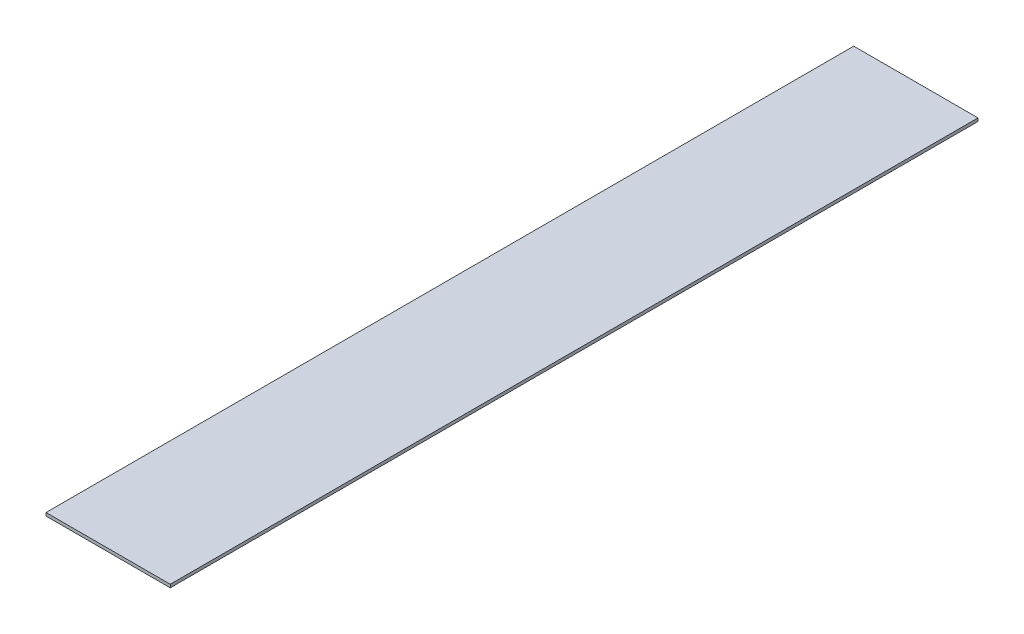
ISO-10303-21;
HEADER;
FILE_DESCRIPTION(('STEP AP214'),'2;1');
FILE_NAME('part.step','',(''),(''),'','','');
FILE_SCHEMA(('AUTOMOTIVE_DESIGN { 1 0 10303 214 1 1 1 1 }'));
ENDSEC;
DATA;
#1=APPLICATION_CONTEXT('core data for automotive mechanical design processes');
#2=APPLICATION_PROTOCOL_DEFINITION('international standard','automotive_design',2000,#1);
#3=PRODUCT_CONTEXT('',#1,'mechanical');
#4=PRODUCT('Part','Part','',(#3));
#5=PRODUCT_RELATED_PRODUCT_CATEGORY('part','',(#4));
#6=PRODUCT_DEFINITION_FORMATION('','',#4);
#7=PRODUCT_DEFINITION_CONTEXT('part definition',#1,'design');
#8=PRODUCT_DEFINITION('design','',#6,#7);
#9=PRODUCT_DEFINITION_SHAPE('','',#8);
#10=(LENGTH_UNIT() NAMED_UNIT(*) SI_UNIT(.MILLI.,.METRE.));
#11=(NAMED_UNIT(*) PLANE_ANGLE_UNIT() SI_UNIT($,.RADIAN.));
#12=(NAMED_UNIT(*) SI_UNIT($,.STERADIAN.) SOLID_ANGLE_UNIT());
#13=UNCERTAINTY_MEASURE_WITH_UNIT(LENGTH_MEASURE(1.E-05),#10,'distance_accuracy_value','');
#14=(GEOMETRIC_REPRESENTATION_CONTEXT(3) GLOBAL_UNCERTAINTY_ASSIGNED_CONTEXT((#13)) GLOBAL_UNIT_ASSIGNED_CONTEXT((#10,
#11,#12)) REPRESENTATION_CONTEXT('',''));
#15=CARTESIAN_POINT('',(0.,0.,0.));
#16=DIRECTION('',(0.,0.,1.));
#17=DIRECTION('',(1.,0.,0.));
#18=AXIS2_PLACEMENT_3D('',#15,#16,#17);
#19=CARTESIAN_POINT('',(-25.4,1.27,165.1));
#20=DIRECTION('',(0.,0.,-1.));
#21=DIRECTION('',(-1.,0.,0.));
#22=AXIS2_PLACEMENT_3D('',#19,#20,#21);
#23=PLANE('',#22);
#24=DIRECTION('',(1.,0.,0.));
#25=VECTOR('',#24,1.);
#26=CARTESIAN_POINT('',(-25.4,0.,165.1));
#27=LINE('',#26,#25);
#28=CARTESIAN_POINT('',(-25.4,0.,165.1));
#29=VERTEX_POINT('',#28);
#30=CARTESIAN_POINT('',(25.4,0.,165.1));
#31=VERTEX_POINT('',#30);
#32=EDGE_CURVE('E99',#29,#31,#27,.T.);
#33=ORIENTED_EDGE('',*,*,#32,.T.);
#34=DIRECTION('',(0.,-1.,0.));
#35=VECTOR('',#34,1.);
#36=CARTESIAN_POINT('',(25.4,1.27,165.1));
#37=LINE('',#36,#35);
#38=CARTESIAN_POINT('',(25.4,1.27,165.1));
#39=VERTEX_POINT('',#38);
#40=EDGE_CURVE('E11',#39,#31,#37,.T.);
#41=ORIENTED_EDGE('',*,*,#40,.F.);
#42=DIRECTION('',(1.,0.,0.));
#43=VECTOR('',#42,1.);
#44=CARTESIAN_POINT('',(-25.4,1.27,165.1));
#45=LINE('',#44,#43);
#46=CARTESIAN_POINT('',(-25.4,1.27,165.1));
#47=VERTEX_POINT('',#46);
#48=EDGE_CURVE('E85',#47,#39,#45,.T.);
#49=ORIENTED_EDGE('',*,*,#48,.F.);
#50=DIRECTION('',(0.,-1.,0.));
#51=VECTOR('',#50,1.);
#52=CARTESIAN_POINT('',(-25.4,1.27,165.1));
#53=LINE('',#52,#51);
#54=EDGE_CURVE('E52',#47,#29,#53,.T.);
#55=ORIENTED_EDGE('',*,*,#54,.T.);
#56=EDGE_LOOP('',(#33,#41,#49,#55));
#57=FACE_BOUND('',#56,.T.);
#58=ADVANCED_FACE('F36',(#57),#23,.F.);
#59=CARTESIAN_POINT('',(25.4,1.27,165.1));
#60=DIRECTION('',(-1.,0.,0.));
#61=DIRECTION('',(0.,0.,1.));
#62=AXIS2_PLACEMENT_3D('',#59,#60,#61);
#63=PLANE('',#62);
#64=DIRECTION('',(0.,0.,-1.));
#65=VECTOR('',#64,1.);
#66=CARTESIAN_POINT('',(25.4,0.,165.1));
#67=LINE('',#66,#65);
#68=CARTESIAN_POINT('',(25.4,0.,-165.1));
#69=VERTEX_POINT('',#68);
#70=EDGE_CURVE('E90',#31,#69,#67,.T.);
#71=ORIENTED_EDGE('',*,*,#70,.T.);
#72=DIRECTION('',(0.,-1.,0.));
#73=VECTOR('',#72,1.);
#74=CARTESIAN_POINT('',(25.4,1.27,-165.1));
#75=LINE('',#74,#73);
#76=CARTESIAN_POINT('',(25.4,1.27,-165.1));
#77=VERTEX_POINT('',#76);
#78=EDGE_CURVE('E44',#77,#69,#75,.T.);
#79=ORIENTED_EDGE('',*,*,#78,.F.);
#80=DIRECTION('',(0.,0.,-1.));
#81=VECTOR('',#80,1.);
#82=CARTESIAN_POINT('',(25.4,1.27,165.1));
#83=LINE('',#82,#81);
#84=EDGE_CURVE('E77',#39,#77,#83,.T.);
#85=ORIENTED_EDGE('',*,*,#84,.F.);
#86=ORIENTED_EDGE('',*,*,#40,.T.);
#87=EDGE_LOOP('',(#71,#79,#85,#86));
#88=FACE_BOUND('',#87,.T.);
#89=ADVANCED_FACE('F89',(#88),#63,.F.);
#90=CARTESIAN_POINT('',(-25.4,1.27,-165.1));
#91=DIRECTION('',(0.,0.,-1.));
#92=DIRECTION('',(-1.,0.,0.));
#93=AXIS2_PLACEMENT_3D('',#90,#91,#92);
#94=PLANE('',#93);
#95=DIRECTION('',(1.,0.,0.));
#96=VECTOR('',#95,1.);
#97=CARTESIAN_POINT('',(-25.4,0.,-165.1));
#98=LINE('',#97,#96);
#99=CARTESIAN_POINT('',(-25.4,0.,-165.1));
#100=VERTEX_POINT('',#99);
#101=EDGE_CURVE('E102',#100,#69,#98,.T.);
#102=ORIENTED_EDGE('',*,*,#101,.F.);
#103=DIRECTION('',(0.,-1.,0.));
#104=VECTOR('',#103,1.);
#105=CARTESIAN_POINT('',(-25.4,1.27,-165.1));
#106=LINE('',#105,#104);
#107=CARTESIAN_POINT('',(-25.4,1.27,-165.1));
#108=VERTEX_POINT('',#107);
#109=EDGE_CURVE('E66',#108,#100,#106,.T.);
#110=ORIENTED_EDGE('',*,*,#109,.F.);
#111=DIRECTION('',(1.,0.,0.));
#112=VECTOR('',#111,1.);
#113=CARTESIAN_POINT('',(-25.4,1.27,-165.1));
#114=LINE('',#113,#112);
#115=EDGE_CURVE('E84',#108,#77,#114,.T.);
#116=ORIENTED_EDGE('',*,*,#115,.T.);
#117=ORIENTED_EDGE('',*,*,#78,.T.);
#118=EDGE_LOOP('',(#102,#110,#116,#117));
#119=FACE_BOUND('',#118,.T.);
#120=ADVANCED_FACE('F93',(#119),#94,.T.);
#121=CARTESIAN_POINT('',(-25.4,1.27,165.1));
#122=DIRECTION('',(-1.,0.,0.));
#123=DIRECTION('',(0.,0.,1.));
#124=AXIS2_PLACEMENT_3D('',#121,#122,#123);
#125=PLANE('',#124);
#126=DIRECTION('',(0.,0.,-1.));
#127=VECTOR('',#126,1.);
#128=CARTESIAN_POINT('',(-25.4,0.,165.1));
#129=LINE('',#128,#127);
#130=EDGE_CURVE('E104',#29,#100,#129,.T.);
#131=ORIENTED_EDGE('',*,*,#130,.F.);
#132=ORIENTED_EDGE('',*,*,#54,.F.);
#133=DIRECTION('',(0.,0.,-1.));
#134=VECTOR('',#133,1.);
#135=CARTESIAN_POINT('',(-25.4,1.27,165.1));
#136=LINE('',#135,#134);
#137=EDGE_CURVE('E94',#47,#108,#136,.T.);
#138=ORIENTED_EDGE('',*,*,#137,.T.);
#139=ORIENTED_EDGE('',*,*,#109,.T.);
#140=EDGE_LOOP('',(#131,#132,#138,#139));
#141=FACE_BOUND('',#140,.T.);
#142=ADVANCED_FACE('F110',(#141),#125,.T.);
#143=CARTESIAN_POINT('',(0.,1.27,0.));
#144=DIRECTION('',(0.,1.,0.));
#145=DIRECTION('',(0.,0.,1.));
#146=AXIS2_PLACEMENT_3D('',#143,#144,#145);
#147=PLANE('',#146);
#148=ORIENTED_EDGE('',*,*,#48,.T.);
#149=ORIENTED_EDGE('',*,*,#84,.T.);
#150=ORIENTED_EDGE('',*,*,#115,.F.);
#151=ORIENTED_EDGE('',*,*,#137,.F.);
#152=EDGE_LOOP('',(#148,#149,#150,#151));
#153=FACE_BOUND('',#152,.T.);
#154=ADVANCED_FACE('F81',(#153),#147,.T.);
#155=CARTESIAN_POINT('',(0.,0.,0.));
#156=DIRECTION('',(0.,1.,0.));
#157=DIRECTION('',(0.,0.,1.));
#158=AXIS2_PLACEMENT_3D('',#155,#156,#157);
#159=PLANE('',#158);
#160=ORIENTED_EDGE('',*,*,#32,.F.);
#161=ORIENTED_EDGE('',*,*,#130,.T.);
#162=ORIENTED_EDGE('',*,*,#101,.T.);
#163=ORIENTED_EDGE('',*,*,#70,.F.);
#164=EDGE_LOOP('',(#160,#161,#162,#163));
#165=FACE_BOUND('',#164,.T.);
#166=ADVANCED_FACE('F109',(#165),#159,.F.);
#167=CLOSED_SHELL('',(#58,#89,#120,#142,#154,#166));
#168=MANIFOLD_SOLID_BREP('B2',#167);
#169=ADVANCED_BREP_SHAPE_REPRESENTATION('',(#18,#168),#14);
#170=SHAPE_DEFINITION_REPRESENTATION(#9,#169);
ENDSEC;
END-ISO-10303-21;
